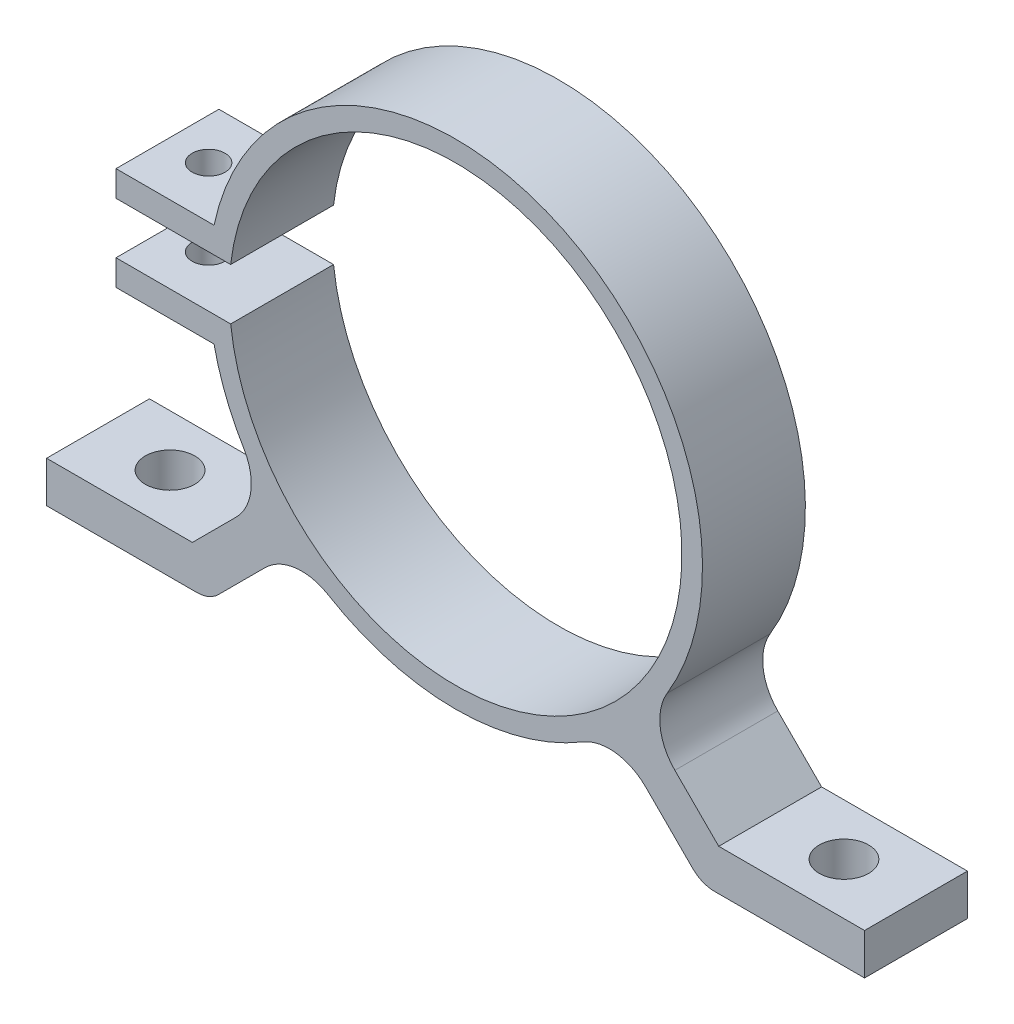
ISO-10303-21;
HEADER;
FILE_DESCRIPTION(('STEP AP214'),'2;1');
FILE_NAME('part.step','',(''),(''),'','','');
FILE_SCHEMA(('AUTOMOTIVE_DESIGN { 1 0 10303 214 1 1 1 1 }'));
ENDSEC;
DATA;
#1=APPLICATION_CONTEXT('core data for automotive mechanical design processes');
#2=APPLICATION_PROTOCOL_DEFINITION('international standard','automotive_design',2000,#1);
#3=PRODUCT_CONTEXT('',#1,'mechanical');
#4=PRODUCT('Part','Part','',(#3));
#5=PRODUCT_RELATED_PRODUCT_CATEGORY('part','',(#4));
#6=PRODUCT_DEFINITION_FORMATION('','',#4);
#7=PRODUCT_DEFINITION_CONTEXT('part definition',#1,'design');
#8=PRODUCT_DEFINITION('design','',#6,#7);
#9=PRODUCT_DEFINITION_SHAPE('','',#8);
#10=(LENGTH_UNIT() NAMED_UNIT(*) SI_UNIT(.MILLI.,.METRE.));
#11=(NAMED_UNIT(*) PLANE_ANGLE_UNIT() SI_UNIT($,.RADIAN.));
#12=(NAMED_UNIT(*) SI_UNIT($,.STERADIAN.) SOLID_ANGLE_UNIT());
#13=UNCERTAINTY_MEASURE_WITH_UNIT(LENGTH_MEASURE(1.E-05),#10,'distance_accuracy_value','');
#14=(GEOMETRIC_REPRESENTATION_CONTEXT(3) GLOBAL_UNCERTAINTY_ASSIGNED_CONTEXT((#13)) GLOBAL_UNIT_ASSIGNED_CONTEXT((#10,
#11,#12)) REPRESENTATION_CONTEXT('',''));
#15=CARTESIAN_POINT('',(0.,0.,0.));
#16=DIRECTION('',(0.,0.,1.));
#17=DIRECTION('',(1.,0.,0.));
#18=AXIS2_PLACEMENT_3D('',#15,#16,#17);
#19=CARTESIAN_POINT('',(0.,0.,5.));
#20=DIRECTION('',(0.,0.,1.));
#21=DIRECTION('',(1.,0.,0.));
#22=AXIS2_PLACEMENT_3D('',#19,#20,#21);
#23=PLANE('',#22);
#24=DIRECTION('',(0.,-1.,0.));
#25=VECTOR('',#24,1.);
#26=CARTESIAN_POINT('',(-33.,5.,5.));
#27=LINE('',#26,#25);
#28=CARTESIAN_POINT('',(-33.,5.,5.));
#29=VERTEX_POINT('',#28);
#30=CARTESIAN_POINT('',(-33.,2.5,5.));
#31=VERTEX_POINT('',#30);
#32=EDGE_CURVE('E247',#29,#31,#27,.T.);
#33=ORIENTED_EDGE('',*,*,#32,.T.);
#34=DIRECTION('',(1.,0.,0.));
#35=VECTOR('',#34,1.);
#36=CARTESIAN_POINT('',(-33.,2.5,5.));
#37=LINE('',#36,#35);
#38=CARTESIAN_POINT('',(-21.8574929943944,2.5,5.));
#39=VERTEX_POINT('',#38);
#40=EDGE_CURVE('E228',#31,#39,#37,.T.);
#41=ORIENTED_EDGE('',*,*,#40,.T.);
#42=CARTESIAN_POINT('',(0.,0.,5.));
#43=DIRECTION('',(0.,0.,1.));
#44=DIRECTION('',(1.,0.,0.));
#45=AXIS2_PLACEMENT_3D('',#42,#43,#44);
#46=CIRCLE('',#45,22.);
#47=CARTESIAN_POINT('',(-21.8574929943944,-2.5,5.));
#48=VERTEX_POINT('',#47);
#49=EDGE_CURVE('E238',#48,#39,#46,.T.);
#50=ORIENTED_EDGE('',*,*,#49,.F.);
#51=DIRECTION('',(1.,0.,0.));
#52=VECTOR('',#51,1.);
#53=CARTESIAN_POINT('',(-33.,-2.5,5.));
#54=LINE('',#53,#52);
#55=CARTESIAN_POINT('',(-33.,-2.5,5.));
#56=VERTEX_POINT('',#55);
#57=EDGE_CURVE('E248',#56,#48,#54,.T.);
#58=ORIENTED_EDGE('',*,*,#57,.F.);
#59=CARTESIAN_POINT('',(-33.,-5.,5.));
#60=VERTEX_POINT('',#59);
#61=EDGE_CURVE('E260',#56,#60,#27,.T.);
#62=ORIENTED_EDGE('',*,*,#61,.T.);
#63=DIRECTION('',(1.,0.,0.));
#64=VECTOR('',#63,1.);
#65=CARTESIAN_POINT('',(-33.,-5.,5.));
#66=LINE('',#65,#64);
#67=CARTESIAN_POINT('',(-23.473389188611,-5.,5.));
#68=VERTEX_POINT('',#67);
#69=EDGE_CURVE('E263',#60,#68,#66,.T.);
#70=ORIENTED_EDGE('',*,*,#69,.T.);
#71=CARTESIAN_POINT('',(0.,0.,5.));
#72=DIRECTION('',(0.,0.,1.));
#73=DIRECTION('',(1.,0.,0.));
#74=AXIS2_PLACEMENT_3D('',#71,#72,#73);
#75=CIRCLE('',#74,24.);
#76=CARTESIAN_POINT('',(-20.5651003120868,-12.3724148473047,5.));
#77=VERTEX_POINT('',#76);
#78=EDGE_CURVE('E376',#68,#77,#75,.T.);
#79=ORIENTED_EDGE('',*,*,#78,.T.);
#80=CARTESIAN_POINT('',(-24.8494962104383,-14.9500012738265,5.));
#81=DIRECTION('',(0.,0.,1.));
#82=DIRECTION('',(1.,0.,0.));
#83=AXIS2_PLACEMENT_3D('',#80,#81,#82);
#84=CIRCLE('',#83,5.);
#85=CARTESIAN_POINT('',(-21.3139623045055,-18.4855351797593,5.));
#86=VERTEX_POINT('',#85);
#87=EDGE_CURVE('E419',#77,#86,#84,.F.);
#88=ORIENTED_EDGE('',*,*,#87,.T.);
#89=DIRECTION('',(0.707106781186549,0.707106781186546,0.));
#90=VECTOR('',#89,1.);
#91=CARTESIAN_POINT('',(-1.41421356237309,1.4142135623731,5.));
#92=LINE('',#91,#90);
#93=CARTESIAN_POINT('',(-25.5771644662754,-22.7487373415291,5.));
#94=VERTEX_POINT('',#93);
#95=EDGE_CURVE('E297',#94,#86,#92,.T.);
#96=ORIENTED_EDGE('',*,*,#95,.F.);
#97=DIRECTION('',(1.,0.,0.));
#98=VECTOR('',#97,1.);
#99=CARTESIAN_POINT('',(-25.1629509039023,-22.7487373415291,5.));
#100=LINE('',#99,#98);
#101=CARTESIAN_POINT('',(-39.7487373415292,-22.7487373415291,5.));
#102=VERTEX_POINT('',#101);
#103=EDGE_CURVE('E300',#102,#94,#100,.T.);
#104=ORIENTED_EDGE('',*,*,#103,.F.);
#105=DIRECTION('',(0.,1.,0.));
#106=VECTOR('',#105,1.);
#107=CARTESIAN_POINT('',(-39.7487373415292,-26.7487373415291,5.));
#108=LINE('',#107,#106);
#109=CARTESIAN_POINT('',(-39.7487373415292,-26.7487373415291,5.));
#110=VERTEX_POINT('',#109);
#111=EDGE_CURVE('E303',#110,#102,#108,.T.);
#112=ORIENTED_EDGE('',*,*,#111,.F.);
#113=DIRECTION('',(1.,0.,0.));
#114=VECTOR('',#113,1.);
#115=CARTESIAN_POINT('',(-25.1629509039023,-26.7487373415291,5.));
#116=LINE('',#115,#114);
#117=CARTESIAN_POINT('',(-25.1629509039023,-26.7487373415291,5.));
#118=VERTEX_POINT('',#117);
#119=EDGE_CURVE('E306',#110,#118,#116,.T.);
#120=ORIENTED_EDGE('',*,*,#119,.T.);
#121=CARTESIAN_POINT('',(-25.1629509039023,-23.7487373415291,5.));
#122=DIRECTION('',(0.,0.,1.));
#123=DIRECTION('',(1.,0.,0.));
#124=AXIS2_PLACEMENT_3D('',#121,#122,#123);
#125=CIRCLE('',#124,3.);
#126=CARTESIAN_POINT('',(-23.0416305603427,-25.8700576850888,5.));
#127=VERTEX_POINT('',#126);
#128=EDGE_CURVE('E308',#118,#127,#125,.T.);
#129=ORIENTED_EDGE('',*,*,#128,.T.);
#130=DIRECTION('',(0.707106781186549,0.707106781186546,0.));
#131=VECTOR('',#130,1.);
#132=CARTESIAN_POINT('',(1.41421356237309,-1.4142135623731,5.));
#133=LINE('',#132,#131);
#134=CARTESIAN_POINT('',(-18.4855351797593,-21.3139623045055,5.));
#135=VERTEX_POINT('',#134);
#136=EDGE_CURVE('E310',#127,#135,#133,.T.);
#137=ORIENTED_EDGE('',*,*,#136,.T.);
#138=CARTESIAN_POINT('',(-14.9500012738266,-24.8494962104382,5.));
#139=DIRECTION('',(0.,0.,1.));
#140=DIRECTION('',(1.,0.,0.));
#141=AXIS2_PLACEMENT_3D('',#138,#139,#140);
#142=CIRCLE('',#141,5.);
#143=CARTESIAN_POINT('',(-12.3724148473048,-20.5651003120868,5.));
#144=VERTEX_POINT('',#143);
#145=EDGE_CURVE('E60',#135,#144,#142,.F.);
#146=ORIENTED_EDGE('',*,*,#145,.T.);
#147=CARTESIAN_POINT('',(12.3724148473048,-20.5651003120868,5.));
#148=VERTEX_POINT('',#147);
#149=EDGE_CURVE('E371',#144,#148,#75,.T.);
#150=ORIENTED_EDGE('',*,*,#149,.T.);
#151=CARTESIAN_POINT('',(14.9500012738266,-24.8494962104382,5.));
#152=DIRECTION('',(0.,0.,1.));
#153=DIRECTION('',(1.,0.,0.));
#154=AXIS2_PLACEMENT_3D('',#151,#152,#153);
#155=CIRCLE('',#154,5.);
#156=CARTESIAN_POINT('',(18.4855351797594,-21.3139623045055,5.));
#157=VERTEX_POINT('',#156);
#158=EDGE_CURVE('E417',#148,#157,#155,.F.);
#159=ORIENTED_EDGE('',*,*,#158,.T.);
#160=DIRECTION('',(0.707106781186549,-0.707106781186546,0.));
#161=VECTOR('',#160,1.);
#162=CARTESIAN_POINT('',(-1.41421356237309,-1.4142135623731,5.));
#163=LINE('',#162,#161);
#164=CARTESIAN_POINT('',(23.0416305603427,-25.8700576850888,5.));
#165=VERTEX_POINT('',#164);
#166=EDGE_CURVE('E313',#157,#165,#163,.T.);
#167=ORIENTED_EDGE('',*,*,#166,.T.);
#168=CARTESIAN_POINT('',(25.1629509039023,-23.7487373415291,5.));
#169=DIRECTION('',(0.,0.,1.));
#170=DIRECTION('',(1.,0.,0.));
#171=AXIS2_PLACEMENT_3D('',#168,#169,#170);
#172=CIRCLE('',#171,3.);
#173=CARTESIAN_POINT('',(25.1629509039023,-26.7487373415291,5.));
#174=VERTEX_POINT('',#173);
#175=EDGE_CURVE('E315',#165,#174,#172,.T.);
#176=ORIENTED_EDGE('',*,*,#175,.T.);
#177=DIRECTION('',(1.,0.,0.));
#178=VECTOR('',#177,1.);
#179=CARTESIAN_POINT('',(25.1629509039023,-26.7487373415291,5.));
#180=LINE('',#179,#178);
#181=CARTESIAN_POINT('',(39.7487373415292,-26.7487373415291,5.));
#182=VERTEX_POINT('',#181);
#183=EDGE_CURVE('E286',#174,#182,#180,.T.);
#184=ORIENTED_EDGE('',*,*,#183,.T.);
#185=DIRECTION('',(0.,-1.,0.));
#186=VECTOR('',#185,1.);
#187=CARTESIAN_POINT('',(39.7487373415292,-22.7487373415291,5.));
#188=LINE('',#187,#186);
#189=CARTESIAN_POINT('',(39.7487373415292,-22.7487373415291,5.));
#190=VERTEX_POINT('',#189);
#191=EDGE_CURVE('E288',#190,#182,#188,.T.);
#192=ORIENTED_EDGE('',*,*,#191,.F.);
#193=DIRECTION('',(1.,0.,0.));
#194=VECTOR('',#193,1.);
#195=CARTESIAN_POINT('',(25.1629509039023,-22.7487373415291,5.));
#196=LINE('',#195,#194);
#197=CARTESIAN_POINT('',(25.5771644662754,-22.7487373415291,5.));
#198=VERTEX_POINT('',#197);
#199=EDGE_CURVE('E292',#198,#190,#196,.T.);
#200=ORIENTED_EDGE('',*,*,#199,.F.);
#201=DIRECTION('',(0.707106781186549,-0.707106781186546,0.));
#202=VECTOR('',#201,1.);
#203=CARTESIAN_POINT('',(1.41421356237309,1.4142135623731,5.));
#204=LINE('',#203,#202);
#205=CARTESIAN_POINT('',(21.3139623045055,-18.4855351797593,5.));
#206=VERTEX_POINT('',#205);
#207=EDGE_CURVE('E295',#206,#198,#204,.T.);
#208=ORIENTED_EDGE('',*,*,#207,.F.);
#209=CARTESIAN_POINT('',(24.8494962104383,-14.9500012738265,5.));
#210=DIRECTION('',(0.,0.,1.));
#211=DIRECTION('',(1.,0.,0.));
#212=AXIS2_PLACEMENT_3D('',#209,#210,#211);
#213=CIRCLE('',#212,5.);
#214=CARTESIAN_POINT('',(20.5651003120868,-12.3724148473047,5.));
#215=VERTEX_POINT('',#214);
#216=EDGE_CURVE('E413',#206,#215,#213,.F.);
#217=ORIENTED_EDGE('',*,*,#216,.T.);
#218=CARTESIAN_POINT('',(-23.473389188611,5.,5.));
#219=VERTEX_POINT('',#218);
#220=EDGE_CURVE('E375',#215,#219,#75,.T.);
#221=ORIENTED_EDGE('',*,*,#220,.T.);
#222=DIRECTION('',(-1.,0.,0.));
#223=VECTOR('',#222,1.);
#224=CARTESIAN_POINT('',(-33.,5.,5.));
#225=LINE('',#224,#223);
#226=EDGE_CURVE('E258',#219,#29,#225,.T.);
#227=ORIENTED_EDGE('',*,*,#226,.T.);
#228=EDGE_LOOP('',(#33,#41,#50,#58,#62,#70,#79,#88,#96,#104,#112,#120,#129,#137,#146,#150,#159,
#167,#176,#184,#192,#200,#208,#217,#221,#227));
#229=FACE_BOUND('',#228,.T.);
#230=ADVANCED_FACE('F52',(#229),#23,.T.);
#231=CARTESIAN_POINT('',(0.,0.,-5.));
#232=DIRECTION('',(0.,0.,1.));
#233=DIRECTION('',(1.,0.,0.));
#234=AXIS2_PLACEMENT_3D('',#231,#232,#233);
#235=PLANE('',#234);
#236=DIRECTION('',(1.,0.,0.));
#237=VECTOR('',#236,1.);
#238=CARTESIAN_POINT('',(0.,2.5,-5.));
#239=LINE('',#238,#237);
#240=CARTESIAN_POINT('',(-33.,2.5,-5.));
#241=VERTEX_POINT('',#240);
#242=CARTESIAN_POINT('',(-21.8574929943944,2.5,-5.));
#243=VERTEX_POINT('',#242);
#244=EDGE_CURVE('E231',#241,#243,#239,.T.);
#245=ORIENTED_EDGE('',*,*,#244,.F.);
#246=DIRECTION('',(0.,-1.,0.));
#247=VECTOR('',#246,1.);
#248=CARTESIAN_POINT('',(-33.,5.,-5.));
#249=LINE('',#248,#247);
#250=CARTESIAN_POINT('',(-33.,5.,-5.));
#251=VERTEX_POINT('',#250);
#252=EDGE_CURVE('E269',#251,#241,#249,.T.);
#253=ORIENTED_EDGE('',*,*,#252,.F.);
#254=DIRECTION('',(-1.,0.,0.));
#255=VECTOR('',#254,1.);
#256=CARTESIAN_POINT('',(-33.,5.,-5.));
#257=LINE('',#256,#255);
#258=CARTESIAN_POINT('',(-23.473389188611,5.,-5.));
#259=VERTEX_POINT('',#258);
#260=EDGE_CURVE('E257',#259,#251,#257,.T.);
#261=ORIENTED_EDGE('',*,*,#260,.F.);
#262=CARTESIAN_POINT('',(0.,0.,-5.));
#263=DIRECTION('',(0.,0.,1.));
#264=DIRECTION('',(1.,0.,0.));
#265=AXIS2_PLACEMENT_3D('',#262,#263,#264);
#266=CIRCLE('',#265,24.);
#267=CARTESIAN_POINT('',(20.5651003120868,-12.3724148473047,-5.));
#268=VERTEX_POINT('',#267);
#269=EDGE_CURVE('E380',#268,#259,#266,.T.);
#270=ORIENTED_EDGE('',*,*,#269,.F.);
#271=CARTESIAN_POINT('',(24.8494962104383,-14.9500012738265,-5.));
#272=DIRECTION('',(0.,0.,1.));
#273=DIRECTION('',(1.,0.,0.));
#274=AXIS2_PLACEMENT_3D('',#271,#272,#273);
#275=CIRCLE('',#274,5.);
#276=CARTESIAN_POINT('',(21.3139623045055,-18.4855351797593,-5.));
#277=VERTEX_POINT('',#276);
#278=EDGE_CURVE('E411',#268,#277,#275,.T.);
#279=ORIENTED_EDGE('',*,*,#278,.T.);
#280=DIRECTION('',(0.707106781186549,-0.707106781186546,0.));
#281=VECTOR('',#280,1.);
#282=CARTESIAN_POINT('',(1.41421356237309,1.4142135623731,-5.));
#283=LINE('',#282,#281);
#284=CARTESIAN_POINT('',(25.5771644662754,-22.7487373415291,-5.));
#285=VERTEX_POINT('',#284);
#286=EDGE_CURVE('E326',#277,#285,#283,.T.);
#287=ORIENTED_EDGE('',*,*,#286,.T.);
#288=DIRECTION('',(1.,0.,0.));
#289=VECTOR('',#288,1.);
#290=CARTESIAN_POINT('',(25.1629509039023,-22.7487373415291,-5.));
#291=LINE('',#290,#289);
#292=CARTESIAN_POINT('',(39.7487373415292,-22.7487373415291,-5.));
#293=VERTEX_POINT('',#292);
#294=EDGE_CURVE('E323',#285,#293,#291,.T.);
#295=ORIENTED_EDGE('',*,*,#294,.T.);
#296=DIRECTION('',(0.,-1.,0.));
#297=VECTOR('',#296,1.);
#298=CARTESIAN_POINT('',(39.7487373415292,-22.7487373415291,-5.));
#299=LINE('',#298,#297);
#300=CARTESIAN_POINT('',(39.7487373415292,-26.7487373415291,-5.));
#301=VERTEX_POINT('',#300);
#302=EDGE_CURVE('E320',#293,#301,#299,.T.);
#303=ORIENTED_EDGE('',*,*,#302,.T.);
#304=DIRECTION('',(1.,0.,0.));
#305=VECTOR('',#304,1.);
#306=CARTESIAN_POINT('',(25.1629509039023,-26.7487373415291,-5.));
#307=LINE('',#306,#305);
#308=CARTESIAN_POINT('',(25.1629509039023,-26.7487373415291,-5.));
#309=VERTEX_POINT('',#308);
#310=EDGE_CURVE('E285',#309,#301,#307,.T.);
#311=ORIENTED_EDGE('',*,*,#310,.F.);
#312=CARTESIAN_POINT('',(25.1629509039023,-23.7487373415291,-5.));
#313=DIRECTION('',(0.,0.,1.));
#314=DIRECTION('',(1.,0.,0.));
#315=AXIS2_PLACEMENT_3D('',#312,#313,#314);
#316=CIRCLE('',#315,3.);
#317=CARTESIAN_POINT('',(23.0416305603427,-25.8700576850888,-5.));
#318=VERTEX_POINT('',#317);
#319=EDGE_CURVE('E289',#318,#309,#316,.T.);
#320=ORIENTED_EDGE('',*,*,#319,.F.);
#321=DIRECTION('',(0.707106781186549,-0.707106781186546,0.));
#322=VECTOR('',#321,1.);
#323=CARTESIAN_POINT('',(-1.41421356237309,-1.4142135623731,-5.));
#324=LINE('',#323,#322);
#325=CARTESIAN_POINT('',(18.4855351797594,-21.3139623045055,-5.));
#326=VERTEX_POINT('',#325);
#327=EDGE_CURVE('E343',#326,#318,#324,.T.);
#328=ORIENTED_EDGE('',*,*,#327,.F.);
#329=CARTESIAN_POINT('',(14.9500012738266,-24.8494962104382,-5.));
#330=DIRECTION('',(0.,0.,1.));
#331=DIRECTION('',(1.,0.,0.));
#332=AXIS2_PLACEMENT_3D('',#329,#330,#331);
#333=CIRCLE('',#332,5.);
#334=CARTESIAN_POINT('',(12.3724148473048,-20.5651003120868,-5.));
#335=VERTEX_POINT('',#334);
#336=EDGE_CURVE('E415',#326,#335,#333,.T.);
#337=ORIENTED_EDGE('',*,*,#336,.T.);
#338=CARTESIAN_POINT('',(-12.3724148473048,-20.5651003120868,-5.));
#339=VERTEX_POINT('',#338);
#340=EDGE_CURVE('E377',#339,#335,#266,.T.);
#341=ORIENTED_EDGE('',*,*,#340,.F.);
#342=CARTESIAN_POINT('',(-14.9500012738266,-24.8494962104382,-5.));
#343=DIRECTION('',(0.,0.,1.));
#344=DIRECTION('',(1.,0.,0.));
#345=AXIS2_PLACEMENT_3D('',#342,#343,#344);
#346=CIRCLE('',#345,5.);
#347=CARTESIAN_POINT('',(-18.4855351797593,-21.3139623045055,-5.));
#348=VERTEX_POINT('',#347);
#349=EDGE_CURVE('E12',#339,#348,#346,.T.);
#350=ORIENTED_EDGE('',*,*,#349,.T.);
#351=DIRECTION('',(0.707106781186549,0.707106781186546,0.));
#352=VECTOR('',#351,1.);
#353=CARTESIAN_POINT('',(1.41421356237309,-1.4142135623731,-5.));
#354=LINE('',#353,#352);
#355=CARTESIAN_POINT('',(-23.0416305603427,-25.8700576850888,-5.));
#356=VERTEX_POINT('',#355);
#357=EDGE_CURVE('E341',#356,#348,#354,.T.);
#358=ORIENTED_EDGE('',*,*,#357,.F.);
#359=CARTESIAN_POINT('',(-25.1629509039023,-23.7487373415291,-5.));
#360=DIRECTION('',(0.,0.,1.));
#361=DIRECTION('',(1.,0.,0.));
#362=AXIS2_PLACEMENT_3D('',#359,#360,#361);
#363=CIRCLE('',#362,3.);
#364=CARTESIAN_POINT('',(-25.1629509039023,-26.7487373415291,-5.));
#365=VERTEX_POINT('',#364);
#366=EDGE_CURVE('E339',#365,#356,#363,.T.);
#367=ORIENTED_EDGE('',*,*,#366,.F.);
#368=DIRECTION('',(1.,0.,0.));
#369=VECTOR('',#368,1.);
#370=CARTESIAN_POINT('',(-25.1629509039023,-26.7487373415291,-5.));
#371=LINE('',#370,#369);
#372=CARTESIAN_POINT('',(-39.7487373415292,-26.7487373415291,-5.));
#373=VERTEX_POINT('',#372);
#374=EDGE_CURVE('E337',#373,#365,#371,.T.);
#375=ORIENTED_EDGE('',*,*,#374,.F.);
#376=DIRECTION('',(0.,1.,0.));
#377=VECTOR('',#376,1.);
#378=CARTESIAN_POINT('',(-39.7487373415292,-26.7487373415291,-5.));
#379=LINE('',#378,#377);
#380=CARTESIAN_POINT('',(-39.7487373415292,-22.7487373415291,-5.));
#381=VERTEX_POINT('',#380);
#382=EDGE_CURVE('E334',#373,#381,#379,.T.);
#383=ORIENTED_EDGE('',*,*,#382,.T.);
#384=DIRECTION('',(1.,0.,0.));
#385=VECTOR('',#384,1.);
#386=CARTESIAN_POINT('',(-25.1629509039023,-22.7487373415291,-5.));
#387=LINE('',#386,#385);
#388=CARTESIAN_POINT('',(-25.5771644662754,-22.7487373415291,-5.));
#389=VERTEX_POINT('',#388);
#390=EDGE_CURVE('E331',#381,#389,#387,.T.);
#391=ORIENTED_EDGE('',*,*,#390,.T.);
#392=DIRECTION('',(0.707106781186549,0.707106781186546,0.));
#393=VECTOR('',#392,1.);
#394=CARTESIAN_POINT('',(-1.41421356237309,1.4142135623731,-5.));
#395=LINE('',#394,#393);
#396=CARTESIAN_POINT('',(-21.3139623045055,-18.4855351797593,-5.));
#397=VERTEX_POINT('',#396);
#398=EDGE_CURVE('E328',#389,#397,#395,.T.);
#399=ORIENTED_EDGE('',*,*,#398,.T.);
#400=CARTESIAN_POINT('',(-24.8494962104383,-14.9500012738265,-5.));
#401=DIRECTION('',(0.,0.,1.));
#402=DIRECTION('',(1.,0.,0.));
#403=AXIS2_PLACEMENT_3D('',#400,#401,#402);
#404=CIRCLE('',#403,5.);
#405=CARTESIAN_POINT('',(-20.5651003120868,-12.3724148473047,-5.));
#406=VERTEX_POINT('',#405);
#407=EDGE_CURVE('E421',#397,#406,#404,.T.);
#408=ORIENTED_EDGE('',*,*,#407,.T.);
#409=CARTESIAN_POINT('',(-23.473389188611,-5.,-5.));
#410=VERTEX_POINT('',#409);
#411=EDGE_CURVE('E370',#410,#406,#266,.T.);
#412=ORIENTED_EDGE('',*,*,#411,.F.);
#413=DIRECTION('',(1.,0.,0.));
#414=VECTOR('',#413,1.);
#415=CARTESIAN_POINT('',(-33.,-5.,-5.));
#416=LINE('',#415,#414);
#417=CARTESIAN_POINT('',(-33.,-5.,-5.));
#418=VERTEX_POINT('',#417);
#419=EDGE_CURVE('E261',#418,#410,#416,.T.);
#420=ORIENTED_EDGE('',*,*,#419,.F.);
#421=CARTESIAN_POINT('',(-33.,-2.5,-5.));
#422=VERTEX_POINT('',#421);
#423=EDGE_CURVE('E268',#422,#418,#249,.T.);
#424=ORIENTED_EDGE('',*,*,#423,.F.);
#425=DIRECTION('',(1.,0.,0.));
#426=VECTOR('',#425,1.);
#427=CARTESIAN_POINT('',(0.,-2.5,-5.));
#428=LINE('',#427,#426);
#429=CARTESIAN_POINT('',(-21.8574929943944,-2.5,-5.));
#430=VERTEX_POINT('',#429);
#431=EDGE_CURVE('E234',#422,#430,#428,.T.);
#432=ORIENTED_EDGE('',*,*,#431,.T.);
#433=CARTESIAN_POINT('',(0.,0.,-5.));
#434=DIRECTION('',(0.,0.,1.));
#435=DIRECTION('',(1.,0.,0.));
#436=AXIS2_PLACEMENT_3D('',#433,#434,#435);
#437=CIRCLE('',#436,22.);
#438=EDGE_CURVE('E385',#430,#243,#437,.T.);
#439=ORIENTED_EDGE('',*,*,#438,.T.);
#440=EDGE_LOOP('',(#245,#253,#261,#270,#279,#287,#295,#303,#311,#320,#328,#337,#341,#350,#358,
#367,#375,#383,#391,#399,#408,#412,#420,#424,#432,#439));
#441=FACE_BOUND('',#440,.T.);
#442=ADVANCED_FACE('F432',(#441),#235,.F.);
#443=CARTESIAN_POINT('',(-33.,5.,5.));
#444=DIRECTION('',(1.,0.,0.));
#445=DIRECTION('',(0.,0.,-1.));
#446=AXIS2_PLACEMENT_3D('',#443,#444,#445);
#447=PLANE('',#446);
#448=DIRECTION('',(0.,0.,-1.));
#449=VECTOR('',#448,1.);
#450=CARTESIAN_POINT('',(-33.,2.5,5.));
#451=LINE('',#450,#449);
#452=EDGE_CURVE('E383',#31,#241,#451,.T.);
#453=ORIENTED_EDGE('',*,*,#452,.F.);
#454=ORIENTED_EDGE('',*,*,#32,.F.);
#455=DIRECTION('',(0.,0.,-1.));
#456=VECTOR('',#455,1.);
#457=CARTESIAN_POINT('',(-33.,5.,5.));
#458=LINE('',#457,#456);
#459=EDGE_CURVE('E276',#29,#251,#458,.T.);
#460=ORIENTED_EDGE('',*,*,#459,.T.);
#461=ORIENTED_EDGE('',*,*,#252,.T.);
#462=EDGE_LOOP('',(#453,#454,#460,#461));
#463=FACE_BOUND('',#462,.T.);
#464=ADVANCED_FACE('F477',(#463),#447,.F.);
#465=CARTESIAN_POINT('',(0.,0.,5.));
#466=DIRECTION('',(0.,0.,-1.));
#467=DIRECTION('',(-1.,0.,0.));
#468=AXIS2_PLACEMENT_3D('',#465,#466,#467);
#469=CYLINDRICAL_SURFACE('',#468,24.);
#470=ORIENTED_EDGE('',*,*,#220,.F.);
#471=DIRECTION('',(0.,0.,-1.));
#472=VECTOR('',#471,1.);
#473=CARTESIAN_POINT('',(20.5651003120868,-12.3724148473047,5.));
#474=LINE('',#473,#472);
#475=EDGE_CURVE('E387',#215,#268,#474,.T.);
#476=ORIENTED_EDGE('',*,*,#475,.T.);
#477=ORIENTED_EDGE('',*,*,#269,.T.);
#478=DIRECTION('',(0.,0.,-1.));
#479=VECTOR('',#478,1.);
#480=CARTESIAN_POINT('',(-23.473389188611,5.,5.));
#481=LINE('',#480,#479);
#482=EDGE_CURVE('E282',#219,#259,#481,.T.);
#483=ORIENTED_EDGE('',*,*,#482,.F.);
#484=EDGE_LOOP('',(#470,#476,#477,#483));
#485=FACE_BOUND('',#484,.T.);
#486=ADVANCED_FACE('F468',(#485),#469,.T.);
#487=ORIENTED_EDGE('',*,*,#411,.T.);
#488=DIRECTION('',(0.,0.,-1.));
#489=VECTOR('',#488,1.);
#490=CARTESIAN_POINT('',(-20.5651003120868,-12.3724148473047,5.));
#491=LINE('',#490,#489);
#492=EDGE_CURVE('E404',#406,#77,#491,.F.);
#493=ORIENTED_EDGE('',*,*,#492,.T.);
#494=ORIENTED_EDGE('',*,*,#78,.F.);
#495=DIRECTION('',(0.,0.,-1.));
#496=VECTOR('',#495,1.);
#497=CARTESIAN_POINT('',(-23.473389188611,-5.,5.));
#498=LINE('',#497,#496);
#499=EDGE_CURVE('E279',#410,#68,#498,.F.);
#500=ORIENTED_EDGE('',*,*,#499,.F.);
#501=EDGE_LOOP('',(#487,#493,#494,#500));
#502=FACE_BOUND('',#501,.T.);
#503=ADVANCED_FACE('F462',(#502),#469,.T.);
#504=ORIENTED_EDGE('',*,*,#340,.T.);
#505=DIRECTION('',(0.,0.,-1.));
#506=VECTOR('',#505,1.);
#507=CARTESIAN_POINT('',(12.3724148473048,-20.5651003120868,5.));
#508=LINE('',#507,#506);
#509=EDGE_CURVE('E402',#335,#148,#508,.F.);
#510=ORIENTED_EDGE('',*,*,#509,.T.);
#511=ORIENTED_EDGE('',*,*,#149,.F.);
#512=DIRECTION('',(0.,0.,-1.));
#513=VECTOR('',#512,1.);
#514=CARTESIAN_POINT('',(-12.3724148473048,-20.5651003120868,5.));
#515=LINE('',#514,#513);
#516=EDGE_CURVE('E400',#144,#339,#515,.T.);
#517=ORIENTED_EDGE('',*,*,#516,.T.);
#518=EDGE_LOOP('',(#504,#510,#511,#517));
#519=FACE_BOUND('',#518,.T.);
#520=ADVANCED_FACE('F426',(#519),#469,.T.);
#521=CARTESIAN_POINT('',(25.1629509039023,-23.7487373415291,5.));
#522=DIRECTION('',(0.,0.,-1.));
#523=DIRECTION('',(-1.,0.,0.));
#524=AXIS2_PLACEMENT_3D('',#521,#522,#523);
#525=CYLINDRICAL_SURFACE('',#524,3.);
#526=ORIENTED_EDGE('',*,*,#319,.T.);
#527=DIRECTION('',(0.,0.,-1.));
#528=VECTOR('',#527,1.);
#529=CARTESIAN_POINT('',(25.1629509039023,-26.7487373415291,5.));
#530=LINE('',#529,#528);
#531=EDGE_CURVE('E317',#174,#309,#530,.T.);
#532=ORIENTED_EDGE('',*,*,#531,.F.);
#533=ORIENTED_EDGE('',*,*,#175,.F.);
#534=DIRECTION('',(0.,0.,-1.));
#535=VECTOR('',#534,1.);
#536=CARTESIAN_POINT('',(23.0416305603427,-25.8700576850888,5.));
#537=LINE('',#536,#535);
#538=EDGE_CURVE('E348',#165,#318,#537,.T.);
#539=ORIENTED_EDGE('',*,*,#538,.T.);
#540=EDGE_LOOP('',(#526,#532,#533,#539));
#541=FACE_BOUND('',#540,.T.);
#542=ADVANCED_FACE('F590',(#541),#525,.T.);
#543=CARTESIAN_POINT('',(25.1629509039023,-26.7487373415291,5.));
#544=DIRECTION('',(0.,1.,0.));
#545=DIRECTION('',(-1.,0.,0.));
#546=AXIS2_PLACEMENT_3D('',#543,#544,#545);
#547=PLANE('',#546);
#548=CARTESIAN_POINT('',(32.7487373415292,-26.7487373415291,0.));
#549=DIRECTION('',(0.,1.,0.));
#550=DIRECTION('',(-1.,0.,0.));
#551=AXIS2_PLACEMENT_3D('',#548,#549,#550);
#552=CIRCLE('',#551,2.4);
#553=CARTESIAN_POINT('',(30.3487373415292,-26.7487373415291,0.));
#554=VERTEX_POINT('',#553);
#555=EDGE_CURVE('E878',#554,#554,#552,.T.);
#556=ORIENTED_EDGE('',*,*,#555,.T.);
#557=EDGE_LOOP('',(#556));
#558=FACE_BOUND('',#557,.T.);
#559=ORIENTED_EDGE('',*,*,#310,.T.);
#560=DIRECTION('',(0.,0.,-1.));
#561=VECTOR('',#560,1.);
#562=CARTESIAN_POINT('',(39.7487373415292,-26.7487373415291,5.));
#563=LINE('',#562,#561);
#564=EDGE_CURVE('E368',#182,#301,#563,.T.);
#565=ORIENTED_EDGE('',*,*,#564,.F.);
#566=ORIENTED_EDGE('',*,*,#183,.F.);
#567=ORIENTED_EDGE('',*,*,#531,.T.);
#568=EDGE_LOOP('',(#559,#565,#566,#567));
#569=FACE_BOUND('',#568,.T.);
#570=ADVANCED_FACE('F497',(#558,#569),#547,.F.);
#571=CARTESIAN_POINT('',(39.7487373415292,-22.7487373415291,5.));
#572=DIRECTION('',(1.,0.,0.));
#573=DIRECTION('',(0.,0.,-1.));
#574=AXIS2_PLACEMENT_3D('',#571,#572,#573);
#575=PLANE('',#574);
#576=ORIENTED_EDGE('',*,*,#302,.F.);
#577=DIRECTION('',(0.,0.,-1.));
#578=VECTOR('',#577,1.);
#579=CARTESIAN_POINT('',(39.7487373415292,-22.7487373415291,5.));
#580=LINE('',#579,#578);
#581=EDGE_CURVE('E366',#190,#293,#580,.T.);
#582=ORIENTED_EDGE('',*,*,#581,.F.);
#583=ORIENTED_EDGE('',*,*,#191,.T.);
#584=ORIENTED_EDGE('',*,*,#564,.T.);
#585=EDGE_LOOP('',(#576,#582,#583,#584));
#586=FACE_BOUND('',#585,.T.);
#587=ADVANCED_FACE('F669',(#586),#575,.T.);
#588=CARTESIAN_POINT('',(25.1629509039023,-22.7487373415291,5.));
#589=DIRECTION('',(0.,1.,0.));
#590=DIRECTION('',(-1.,0.,0.));
#591=AXIS2_PLACEMENT_3D('',#588,#589,#590);
#592=PLANE('',#591);
#593=CARTESIAN_POINT('',(32.7487373415292,-22.7487373415291,0.));
#594=DIRECTION('',(0.,1.,0.));
#595=DIRECTION('',(-1.,0.,0.));
#596=AXIS2_PLACEMENT_3D('',#593,#594,#595);
#597=CIRCLE('',#596,2.4);
#598=CARTESIAN_POINT('',(30.3487373415292,-22.7487373415291,0.));
#599=VERTEX_POINT('',#598);
#600=EDGE_CURVE('E875',#599,#599,#597,.T.);
#601=ORIENTED_EDGE('',*,*,#600,.F.);
#602=EDGE_LOOP('',(#601));
#603=FACE_BOUND('',#602,.T.);
#604=ORIENTED_EDGE('',*,*,#294,.F.);
#605=DIRECTION('',(0.,0.,-1.));
#606=VECTOR('',#605,1.);
#607=CARTESIAN_POINT('',(25.5771644662754,-22.7487373415291,5.));
#608=LINE('',#607,#606);
#609=EDGE_CURVE('E363',#198,#285,#608,.T.);
#610=ORIENTED_EDGE('',*,*,#609,.F.);
#611=ORIENTED_EDGE('',*,*,#199,.T.);
#612=ORIENTED_EDGE('',*,*,#581,.T.);
#613=EDGE_LOOP('',(#604,#610,#611,#612));
#614=FACE_BOUND('',#613,.T.);
#615=ADVANCED_FACE('F577',(#603,#614),#592,.T.);
#616=CARTESIAN_POINT('',(-1.41421356237309,-1.4142135623731,5.));
#617=DIRECTION('',(0.707106781186546,0.707106781186549,0.));
#618=DIRECTION('',(-0.707106781186549,0.707106781186546,0.));
#619=AXIS2_PLACEMENT_3D('',#616,#617,#618);
#620=PLANE('',#619);
#621=ORIENTED_EDGE('',*,*,#166,.F.);
#622=DIRECTION('',(0.,0.,1.));
#623=VECTOR('',#622,1.);
#624=CARTESIAN_POINT('',(18.4855351797594,-21.3139623045055,-5.));
#625=LINE('',#624,#623);
#626=EDGE_CURVE('E397',#157,#326,#625,.F.);
#627=ORIENTED_EDGE('',*,*,#626,.T.);
#628=ORIENTED_EDGE('',*,*,#327,.T.);
#629=ORIENTED_EDGE('',*,*,#538,.F.);
#630=EDGE_LOOP('',(#621,#627,#628,#629));
#631=FACE_BOUND('',#630,.T.);
#632=ADVANCED_FACE('F566',(#631),#620,.F.);
#633=CARTESIAN_POINT('',(1.41421356237309,1.4142135623731,5.));
#634=DIRECTION('',(0.707106781186546,0.707106781186549,0.));
#635=DIRECTION('',(-0.707106781186549,0.707106781186546,0.));
#636=AXIS2_PLACEMENT_3D('',#633,#634,#635);
#637=PLANE('',#636);
#638=ORIENTED_EDGE('',*,*,#286,.F.);
#639=DIRECTION('',(0.,0.,-1.));
#640=VECTOR('',#639,1.);
#641=CARTESIAN_POINT('',(21.3139623045055,-18.4855351797593,5.));
#642=LINE('',#641,#640);
#643=EDGE_CURVE('E395',#277,#206,#642,.F.);
#644=ORIENTED_EDGE('',*,*,#643,.T.);
#645=ORIENTED_EDGE('',*,*,#207,.T.);
#646=ORIENTED_EDGE('',*,*,#609,.T.);
#647=EDGE_LOOP('',(#638,#644,#645,#646));
#648=FACE_BOUND('',#647,.T.);
#649=ADVANCED_FACE('F556',(#648),#637,.T.);
#650=CARTESIAN_POINT('',(-1.41421356237309,1.4142135623731,5.));
#651=DIRECTION('',(-0.707106781186546,0.707106781186549,0.));
#652=DIRECTION('',(-0.707106781186549,-0.707106781186546,0.));
#653=AXIS2_PLACEMENT_3D('',#650,#651,#652);
#654=PLANE('',#653);
#655=ORIENTED_EDGE('',*,*,#95,.T.);
#656=DIRECTION('',(0.,0.,-1.));
#657=VECTOR('',#656,1.);
#658=CARTESIAN_POINT('',(-21.3139623045055,-18.4855351797593,5.));
#659=LINE('',#658,#657);
#660=EDGE_CURVE('E407',#86,#397,#659,.T.);
#661=ORIENTED_EDGE('',*,*,#660,.T.);
#662=ORIENTED_EDGE('',*,*,#398,.F.);
#663=DIRECTION('',(0.,0.,-1.));
#664=VECTOR('',#663,1.);
#665=CARTESIAN_POINT('',(-25.5771644662754,-22.7487373415291,5.));
#666=LINE('',#665,#664);
#667=EDGE_CURVE('E361',#94,#389,#666,.T.);
#668=ORIENTED_EDGE('',*,*,#667,.F.);
#669=EDGE_LOOP('',(#655,#661,#662,#668));
#670=FACE_BOUND('',#669,.T.);
#671=ADVANCED_FACE('F453',(#670),#654,.T.);
#672=CARTESIAN_POINT('',(1.41421356237309,-1.4142135623731,5.));
#673=DIRECTION('',(-0.707106781186546,0.707106781186549,0.));
#674=DIRECTION('',(-0.707106781186549,-0.707106781186546,0.));
#675=AXIS2_PLACEMENT_3D('',#672,#673,#674);
#676=PLANE('',#675);
#677=ORIENTED_EDGE('',*,*,#357,.T.);
#678=DIRECTION('',(0.,0.,1.));
#679=VECTOR('',#678,1.);
#680=CARTESIAN_POINT('',(-18.4855351797593,-21.3139623045055,5.));
#681=LINE('',#680,#679);
#682=EDGE_CURVE('E409',#348,#135,#681,.T.);
#683=ORIENTED_EDGE('',*,*,#682,.T.);
#684=ORIENTED_EDGE('',*,*,#136,.F.);
#685=DIRECTION('',(0.,0.,-1.));
#686=VECTOR('',#685,1.);
#687=CARTESIAN_POINT('',(-23.0416305603427,-25.8700576850888,5.));
#688=LINE('',#687,#686);
#689=EDGE_CURVE('E351',#127,#356,#688,.T.);
#690=ORIENTED_EDGE('',*,*,#689,.T.);
#691=EDGE_LOOP('',(#677,#683,#684,#690));
#692=FACE_BOUND('',#691,.T.);
#693=ADVANCED_FACE('F429',(#692),#676,.F.);
#694=CARTESIAN_POINT('',(-25.1629509039023,-22.7487373415291,5.));
#695=DIRECTION('',(0.,1.,0.));
#696=DIRECTION('',(0.,0.,1.));
#697=AXIS2_PLACEMENT_3D('',#694,#695,#696);
#698=PLANE('',#697);
#699=CARTESIAN_POINT('',(-32.7487373415292,-22.7487373415291,0.));
#700=DIRECTION('',(0.,1.,0.));
#701=DIRECTION('',(-1.,0.,0.));
#702=AXIS2_PLACEMENT_3D('',#699,#700,#701);
#703=CIRCLE('',#702,2.4);
#704=CARTESIAN_POINT('',(-35.1487373415292,-22.7487373415291,0.));
#705=VERTEX_POINT('',#704);
#706=EDGE_CURVE('E881',#705,#705,#703,.T.);
#707=ORIENTED_EDGE('',*,*,#706,.F.);
#708=EDGE_LOOP('',(#707));
#709=FACE_BOUND('',#708,.T.);
#710=ORIENTED_EDGE('',*,*,#390,.F.);
#711=DIRECTION('',(0.,0.,-1.));
#712=VECTOR('',#711,1.);
#713=CARTESIAN_POINT('',(-39.7487373415292,-22.7487373415291,5.));
#714=LINE('',#713,#712);
#715=EDGE_CURVE('E359',#102,#381,#714,.T.);
#716=ORIENTED_EDGE('',*,*,#715,.F.);
#717=ORIENTED_EDGE('',*,*,#103,.T.);
#718=ORIENTED_EDGE('',*,*,#667,.T.);
#719=EDGE_LOOP('',(#710,#716,#717,#718));
#720=FACE_BOUND('',#719,.T.);
#721=ADVANCED_FACE('F449',(#709,#720),#698,.T.);
#722=CARTESIAN_POINT('',(-39.7487373415292,-26.7487373415291,5.));
#723=DIRECTION('',(-1.,0.,0.));
#724=DIRECTION('',(0.,0.,1.));
#725=AXIS2_PLACEMENT_3D('',#722,#723,#724);
#726=PLANE('',#725);
#727=ORIENTED_EDGE('',*,*,#382,.F.);
#728=DIRECTION('',(0.,0.,-1.));
#729=VECTOR('',#728,1.);
#730=CARTESIAN_POINT('',(-39.7487373415292,-26.7487373415291,5.));
#731=LINE('',#730,#729);
#732=EDGE_CURVE('E357',#110,#373,#731,.T.);
#733=ORIENTED_EDGE('',*,*,#732,.F.);
#734=ORIENTED_EDGE('',*,*,#111,.T.);
#735=ORIENTED_EDGE('',*,*,#715,.T.);
#736=EDGE_LOOP('',(#727,#733,#734,#735));
#737=FACE_BOUND('',#736,.T.);
#738=ADVANCED_FACE('F444',(#737),#726,.T.);
#739=CARTESIAN_POINT('',(-25.1629509039023,-26.7487373415291,5.));
#740=DIRECTION('',(0.,1.,0.));
#741=DIRECTION('',(0.,0.,1.));
#742=AXIS2_PLACEMENT_3D('',#739,#740,#741);
#743=PLANE('',#742);
#744=CARTESIAN_POINT('',(-32.7487373415292,-26.7487373415291,0.));
#745=DIRECTION('',(0.,1.,0.));
#746=DIRECTION('',(-1.,0.,0.));
#747=AXIS2_PLACEMENT_3D('',#744,#745,#746);
#748=CIRCLE('',#747,2.4);
#749=CARTESIAN_POINT('',(-35.1487373415292,-26.7487373415291,0.));
#750=VERTEX_POINT('',#749);
#751=EDGE_CURVE('E874',#750,#750,#748,.T.);
#752=ORIENTED_EDGE('',*,*,#751,.T.);
#753=EDGE_LOOP('',(#752));
#754=FACE_BOUND('',#753,.T.);
#755=ORIENTED_EDGE('',*,*,#374,.T.);
#756=DIRECTION('',(0.,0.,-1.));
#757=VECTOR('',#756,1.);
#758=CARTESIAN_POINT('',(-25.1629509039023,-26.7487373415291,5.));
#759=LINE('',#758,#757);
#760=EDGE_CURVE('E354',#118,#365,#759,.T.);
#761=ORIENTED_EDGE('',*,*,#760,.F.);
#762=ORIENTED_EDGE('',*,*,#119,.F.);
#763=ORIENTED_EDGE('',*,*,#732,.T.);
#764=EDGE_LOOP('',(#755,#761,#762,#763));
#765=FACE_BOUND('',#764,.T.);
#766=ADVANCED_FACE('F441',(#754,#765),#743,.F.);
#767=CARTESIAN_POINT('',(-25.1629509039023,-23.7487373415291,5.));
#768=DIRECTION('',(0.,0.,-1.));
#769=DIRECTION('',(-1.,0.,0.));
#770=AXIS2_PLACEMENT_3D('',#767,#768,#769);
#771=CYLINDRICAL_SURFACE('',#770,3.);
#772=ORIENTED_EDGE('',*,*,#366,.T.);
#773=ORIENTED_EDGE('',*,*,#689,.F.);
#774=ORIENTED_EDGE('',*,*,#128,.F.);
#775=ORIENTED_EDGE('',*,*,#760,.T.);
#776=EDGE_LOOP('',(#772,#773,#774,#775));
#777=FACE_BOUND('',#776,.T.);
#778=ADVANCED_FACE('F436',(#777),#771,.T.);
#779=CARTESIAN_POINT('',(-33.,5.,5.));
#780=DIRECTION('',(0.,-1.,0.));
#781=DIRECTION('',(1.,0.,0.));
#782=AXIS2_PLACEMENT_3D('',#779,#780,#781);
#783=PLANE('',#782);
#784=CARTESIAN_POINT('',(-29.,5.,0.));
#785=DIRECTION('',(0.,-1.,0.));
#786=DIRECTION('',(1.,0.,0.));
#787=AXIS2_PLACEMENT_3D('',#784,#785,#786);
#788=CIRCLE('',#787,1.6);
#789=CARTESIAN_POINT('',(-27.4,5.,0.));
#790=VERTEX_POINT('',#789);
#791=EDGE_CURVE('E250',#790,#790,#788,.T.);
#792=ORIENTED_EDGE('',*,*,#791,.T.);
#793=EDGE_LOOP('',(#792));
#794=FACE_BOUND('',#793,.T.);
#795=ORIENTED_EDGE('',*,*,#226,.F.);
#796=ORIENTED_EDGE('',*,*,#482,.T.);
#797=ORIENTED_EDGE('',*,*,#260,.T.);
#798=ORIENTED_EDGE('',*,*,#459,.F.);
#799=EDGE_LOOP('',(#795,#796,#797,#798));
#800=FACE_BOUND('',#799,.T.);
#801=ADVANCED_FACE('F473',(#794,#800),#783,.F.);
#802=CARTESIAN_POINT('',(-33.,-5.,5.));
#803=DIRECTION('',(0.,1.,0.));
#804=DIRECTION('',(-1.,0.,0.));
#805=AXIS2_PLACEMENT_3D('',#802,#803,#804);
#806=PLANE('',#805);
#807=CARTESIAN_POINT('',(-29.,-5.,0.));
#808=DIRECTION('',(0.,1.,0.));
#809=DIRECTION('',(-1.,0.,0.));
#810=AXIS2_PLACEMENT_3D('',#807,#808,#809);
#811=CIRCLE('',#810,1.6);
#812=CARTESIAN_POINT('',(-30.6,-5.,0.));
#813=VERTEX_POINT('',#812);
#814=EDGE_CURVE('E392',#813,#813,#811,.F.);
#815=ORIENTED_EDGE('',*,*,#814,.F.);
#816=EDGE_LOOP('',(#815));
#817=FACE_BOUND('',#816,.T.);
#818=ORIENTED_EDGE('',*,*,#419,.T.);
#819=ORIENTED_EDGE('',*,*,#499,.T.);
#820=ORIENTED_EDGE('',*,*,#69,.F.);
#821=DIRECTION('',(0.,0.,-1.));
#822=VECTOR('',#821,1.);
#823=CARTESIAN_POINT('',(-33.,-5.,5.));
#824=LINE('',#823,#822);
#825=EDGE_CURVE('E266',#60,#418,#824,.T.);
#826=ORIENTED_EDGE('',*,*,#825,.T.);
#827=EDGE_LOOP('',(#818,#819,#820,#826));
#828=FACE_BOUND('',#827,.T.);
#829=ADVANCED_FACE('F490',(#817,#828),#806,.F.);
#830=ORIENTED_EDGE('',*,*,#61,.F.);
#831=DIRECTION('',(0.,0.,-1.));
#832=VECTOR('',#831,1.);
#833=CARTESIAN_POINT('',(-33.,-2.5,5.));
#834=LINE('',#833,#832);
#835=EDGE_CURVE('E374',#56,#422,#834,.T.);
#836=ORIENTED_EDGE('',*,*,#835,.T.);
#837=ORIENTED_EDGE('',*,*,#423,.T.);
#838=ORIENTED_EDGE('',*,*,#825,.F.);
#839=EDGE_LOOP('',(#830,#836,#837,#838));
#840=FACE_BOUND('',#839,.T.);
#841=ADVANCED_FACE('F480',(#840),#447,.F.);
#842=CARTESIAN_POINT('',(0.,0.,-21.5));
#843=DIRECTION('',(0.,0.,1.));
#844=DIRECTION('',(1.,0.,0.));
#845=AXIS2_PLACEMENT_3D('',#842,#843,#844);
#846=CYLINDRICAL_SURFACE('',#845,22.);
#847=DIRECTION('',(0.,0.,1.));
#848=VECTOR('',#847,1.);
#849=CARTESIAN_POINT('',(-21.8574929943944,-2.5,-21.5));
#850=LINE('',#849,#848);
#851=EDGE_CURVE('E235',#430,#48,#850,.T.);
#852=ORIENTED_EDGE('',*,*,#851,.T.);
#853=ORIENTED_EDGE('',*,*,#49,.T.);
#854=DIRECTION('',(0.,0.,1.));
#855=VECTOR('',#854,1.);
#856=CARTESIAN_POINT('',(-21.8574929943944,2.5,-21.5));
#857=LINE('',#856,#855);
#858=EDGE_CURVE('E224',#243,#39,#857,.T.);
#859=ORIENTED_EDGE('',*,*,#858,.F.);
#860=ORIENTED_EDGE('',*,*,#438,.F.);
#861=EDGE_LOOP('',(#852,#853,#859,#860));
#862=FACE_BOUND('',#861,.T.);
#863=ADVANCED_FACE('F239',(#862),#846,.F.);
#864=CARTESIAN_POINT('',(-33.,2.5,-21.5));
#865=DIRECTION('',(0.,-1.,0.));
#866=DIRECTION('',(0.,0.,-1.));
#867=AXIS2_PLACEMENT_3D('',#864,#865,#866);
#868=PLANE('',#867);
#869=CARTESIAN_POINT('',(-29.,2.5,0.));
#870=DIRECTION('',(0.,-1.,0.));
#871=DIRECTION('',(0.,0.,-1.));
#872=AXIS2_PLACEMENT_3D('',#869,#870,#871);
#873=CIRCLE('',#872,1.6);
#874=CARTESIAN_POINT('',(-29.,2.5,-1.6));
#875=VERTEX_POINT('',#874);
#876=EDGE_CURVE('E391',#875,#875,#873,.T.);
#877=ORIENTED_EDGE('',*,*,#876,.F.);
#878=EDGE_LOOP('',(#877));
#879=FACE_BOUND('',#878,.T.);
#880=ORIENTED_EDGE('',*,*,#244,.T.);
#881=ORIENTED_EDGE('',*,*,#858,.T.);
#882=ORIENTED_EDGE('',*,*,#40,.F.);
#883=ORIENTED_EDGE('',*,*,#452,.T.);
#884=EDGE_LOOP('',(#880,#881,#882,#883));
#885=FACE_BOUND('',#884,.T.);
#886=ADVANCED_FACE('F226',(#879,#885),#868,.T.);
#887=CARTESIAN_POINT('',(-33.,-2.5,-21.5));
#888=DIRECTION('',(0.,-1.,0.));
#889=DIRECTION('',(0.,0.,-1.));
#890=AXIS2_PLACEMENT_3D('',#887,#888,#889);
#891=PLANE('',#890);
#892=CARTESIAN_POINT('',(-29.,-2.5,0.));
#893=DIRECTION('',(0.,-1.,0.));
#894=DIRECTION('',(0.,0.,-1.));
#895=AXIS2_PLACEMENT_3D('',#892,#893,#894);
#896=CIRCLE('',#895,1.6);
#897=CARTESIAN_POINT('',(-29.,-2.5,-1.6));
#898=VERTEX_POINT('',#897);
#899=EDGE_CURVE('E388',#898,#898,#896,.T.);
#900=ORIENTED_EDGE('',*,*,#899,.T.);
#901=EDGE_LOOP('',(#900));
#902=FACE_BOUND('',#901,.T.);
#903=ORIENTED_EDGE('',*,*,#835,.F.);
#904=ORIENTED_EDGE('',*,*,#57,.T.);
#905=ORIENTED_EDGE('',*,*,#851,.F.);
#906=ORIENTED_EDGE('',*,*,#431,.F.);
#907=EDGE_LOOP('',(#903,#904,#905,#906));
#908=FACE_BOUND('',#907,.T.);
#909=ADVANCED_FACE('F701',(#902,#908),#891,.F.);
#910=CARTESIAN_POINT('',(-29.,-9.52548339959391,0.));
#911=DIRECTION('',(0.,1.,0.));
#912=DIRECTION('',(-1.,0.,0.));
#913=AXIS2_PLACEMENT_3D('',#910,#911,#912);
#914=CYLINDRICAL_SURFACE('',#913,1.6);
#915=ORIENTED_EDGE('',*,*,#814,.T.);
#916=EDGE_LOOP('',(#915));
#917=FACE_BOUND('',#916,.T.);
#918=ORIENTED_EDGE('',*,*,#899,.F.);
#919=EDGE_LOOP('',(#918));
#920=FACE_BOUND('',#919,.T.);
#921=ADVANCED_FACE('F690',(#917,#920),#914,.F.);
#922=ORIENTED_EDGE('',*,*,#876,.T.);
#923=EDGE_LOOP('',(#922));
#924=FACE_BOUND('',#923,.T.);
#925=ORIENTED_EDGE('',*,*,#791,.F.);
#926=EDGE_LOOP('',(#925));
#927=FACE_BOUND('',#926,.T.);
#928=ADVANCED_FACE('F636',(#924,#927),#914,.F.);
#929=CARTESIAN_POINT('',(-32.7487373415292,-26.7487373415291,0.));
#930=DIRECTION('',(0.,1.,0.));
#931=DIRECTION('',(-1.,0.,0.));
#932=AXIS2_PLACEMENT_3D('',#929,#930,#931);
#933=CYLINDRICAL_SURFACE('',#932,2.4);
#934=ORIENTED_EDGE('',*,*,#751,.F.);
#935=EDGE_LOOP('',(#934));
#936=FACE_BOUND('',#935,.T.);
#937=ORIENTED_EDGE('',*,*,#706,.T.);
#938=EDGE_LOOP('',(#937));
#939=FACE_BOUND('',#938,.T.);
#940=ADVANCED_FACE('F625',(#936,#939),#933,.F.);
#941=CARTESIAN_POINT('',(32.7487373415292,-26.7487373415291,0.));
#942=DIRECTION('',(0.,1.,0.));
#943=DIRECTION('',(-1.,0.,0.));
#944=AXIS2_PLACEMENT_3D('',#941,#942,#943);
#945=CYLINDRICAL_SURFACE('',#944,2.4);
#946=ORIENTED_EDGE('',*,*,#555,.F.);
#947=EDGE_LOOP('',(#946));
#948=FACE_BOUND('',#947,.T.);
#949=ORIENTED_EDGE('',*,*,#600,.T.);
#950=EDGE_LOOP('',(#949));
#951=FACE_BOUND('',#950,.T.);
#952=ADVANCED_FACE('F504',(#948,#951),#945,.F.);
#953=CARTESIAN_POINT('',(24.8494962104383,-14.9500012738265,5.));
#954=DIRECTION('',(0.,0.,-1.));
#955=DIRECTION('',(-1.,0.,0.));
#956=AXIS2_PLACEMENT_3D('',#953,#954,#955);
#957=CYLINDRICAL_SURFACE('',#956,5.);
#958=ORIENTED_EDGE('',*,*,#216,.F.);
#959=ORIENTED_EDGE('',*,*,#643,.F.);
#960=ORIENTED_EDGE('',*,*,#278,.F.);
#961=ORIENTED_EDGE('',*,*,#475,.F.);
#962=EDGE_LOOP('',(#958,#959,#960,#961));
#963=FACE_BOUND('',#962,.T.);
#964=ADVANCED_FACE('F500',(#963),#957,.F.);
#965=CARTESIAN_POINT('',(14.9500012738266,-24.8494962104382,5.));
#966=DIRECTION('',(0.,0.,-1.));
#967=DIRECTION('',(-1.,0.,0.));
#968=AXIS2_PLACEMENT_3D('',#965,#966,#967);
#969=CYLINDRICAL_SURFACE('',#968,5.);
#970=ORIENTED_EDGE('',*,*,#158,.F.);
#971=ORIENTED_EDGE('',*,*,#509,.F.);
#972=ORIENTED_EDGE('',*,*,#336,.F.);
#973=ORIENTED_EDGE('',*,*,#626,.F.);
#974=EDGE_LOOP('',(#970,#971,#972,#973));
#975=FACE_BOUND('',#974,.T.);
#976=ADVANCED_FACE('F503',(#975),#969,.F.);
#977=CARTESIAN_POINT('',(-24.8494962104383,-14.9500012738265,5.));
#978=DIRECTION('',(0.,0.,-1.));
#979=DIRECTION('',(-1.,0.,0.));
#980=AXIS2_PLACEMENT_3D('',#977,#978,#979);
#981=CYLINDRICAL_SURFACE('',#980,5.);
#982=ORIENTED_EDGE('',*,*,#407,.F.);
#983=ORIENTED_EDGE('',*,*,#660,.F.);
#984=ORIENTED_EDGE('',*,*,#87,.F.);
#985=ORIENTED_EDGE('',*,*,#492,.F.);
#986=EDGE_LOOP('',(#982,#983,#984,#985));
#987=FACE_BOUND('',#986,.T.);
#988=ADVANCED_FACE('F456',(#987),#981,.F.);
#989=CARTESIAN_POINT('',(-14.9500012738266,-24.8494962104382,5.));
#990=DIRECTION('',(0.,0.,-1.));
#991=DIRECTION('',(-1.,0.,0.));
#992=AXIS2_PLACEMENT_3D('',#989,#990,#991);
#993=CYLINDRICAL_SURFACE('',#992,5.);
#994=ORIENTED_EDGE('',*,*,#349,.F.);
#995=ORIENTED_EDGE('',*,*,#516,.F.);
#996=ORIENTED_EDGE('',*,*,#145,.F.);
#997=ORIENTED_EDGE('',*,*,#682,.F.);
#998=EDGE_LOOP('',(#994,#995,#996,#997));
#999=FACE_BOUND('',#998,.T.);
#1000=ADVANCED_FACE('F54',(#999),#993,.F.);
#1001=CLOSED_SHELL('',(#230,#442,#464,#486,#503,#520,#542,#570,#587,#615,#632,#649,#671,#693,
#721,#738,#766,#778,#801,#829,#841,#863,#886,#909,#921,#928,#940,#952,#964,#976,#988,#1000));
#1002=MANIFOLD_SOLID_BREP('B2',#1001);
#1003=ADVANCED_BREP_SHAPE_REPRESENTATION('',(#18,#1002),#14);
#1004=SHAPE_DEFINITION_REPRESENTATION(#9,#1003);
ENDSEC;
END-ISO-10303-21;
